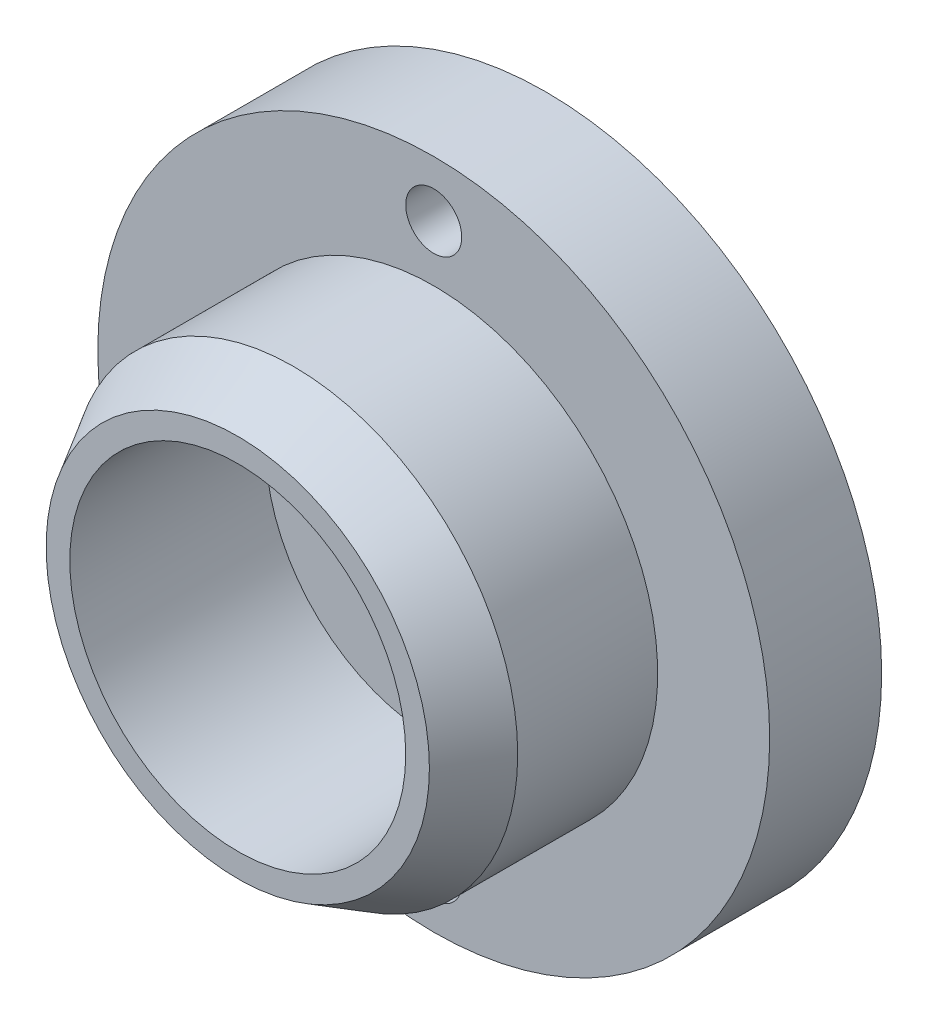
ISO-10303-21;
HEADER;
FILE_DESCRIPTION(('STEP AP214'),'2;1');
FILE_NAME('part.step','',(''),(''),'','','');
FILE_SCHEMA(('AUTOMOTIVE_DESIGN { 1 0 10303 214 1 1 1 1 }'));
ENDSEC;
DATA;
#1=APPLICATION_CONTEXT('core data for automotive mechanical design processes');
#2=APPLICATION_PROTOCOL_DEFINITION('international standard','automotive_design',2000,#1);
#3=PRODUCT_CONTEXT('',#1,'mechanical');
#4=PRODUCT('Part','Part','',(#3));
#5=PRODUCT_RELATED_PRODUCT_CATEGORY('part','',(#4));
#6=PRODUCT_DEFINITION_FORMATION('','',#4);
#7=PRODUCT_DEFINITION_CONTEXT('part definition',#1,'design');
#8=PRODUCT_DEFINITION('design','',#6,#7);
#9=PRODUCT_DEFINITION_SHAPE('','',#8);
#10=(LENGTH_UNIT() NAMED_UNIT(*) SI_UNIT(.MILLI.,.METRE.));
#11=(NAMED_UNIT(*) PLANE_ANGLE_UNIT() SI_UNIT($,.RADIAN.));
#12=(NAMED_UNIT(*) SI_UNIT($,.STERADIAN.) SOLID_ANGLE_UNIT());
#13=UNCERTAINTY_MEASURE_WITH_UNIT(LENGTH_MEASURE(1.E-05),#10,'distance_accuracy_value','');
#14=(GEOMETRIC_REPRESENTATION_CONTEXT(3) GLOBAL_UNCERTAINTY_ASSIGNED_CONTEXT((#13)) GLOBAL_UNIT_ASSIGNED_CONTEXT((#10,
#11,#12)) REPRESENTATION_CONTEXT('',''));
#15=CARTESIAN_POINT('',(0.,0.,0.));
#16=DIRECTION('',(0.,0.,1.));
#17=DIRECTION('',(1.,0.,0.));
#18=AXIS2_PLACEMENT_3D('',#15,#16,#17);
#19=CARTESIAN_POINT('',(0.,0.,3.5));
#20=DIRECTION('',(0.,0.,1.));
#21=DIRECTION('',(1.,0.,0.));
#22=AXIS2_PLACEMENT_3D('',#19,#20,#21);
#23=PLANE('',#22);
#24=CARTESIAN_POINT('',(0.,0.,3.5));
#25=DIRECTION('',(0.,0.,1.));
#26=DIRECTION('',(1.,0.,0.));
#27=AXIS2_PLACEMENT_3D('',#24,#25,#26);
#28=CIRCLE('',#27,3.42264973081038);
#29=CARTESIAN_POINT('',(3.42264973081038,0.,3.5));
#30=VERTEX_POINT('',#29);
#31=EDGE_CURVE('E37',#30,#30,#28,.T.);
#32=ORIENTED_EDGE('',*,*,#31,.T.);
#33=EDGE_LOOP('',(#32));
#34=FACE_BOUND('',#33,.T.);
#35=CARTESIAN_POINT('',(0.,0.,3.5));
#36=DIRECTION('',(0.,0.,1.));
#37=DIRECTION('',(1.,0.,0.));
#38=AXIS2_PLACEMENT_3D('',#35,#36,#37);
#39=CIRCLE('',#38,3.);
#40=CARTESIAN_POINT('',(3.,0.,3.5));
#41=VERTEX_POINT('',#40);
#42=EDGE_CURVE('E41',#41,#41,#39,.T.);
#43=ORIENTED_EDGE('',*,*,#42,.F.);
#44=EDGE_LOOP('',(#43));
#45=FACE_BOUND('',#44,.T.);
#46=ADVANCED_FACE('F30',(#34,#45),#23,.T.);
#47=CARTESIAN_POINT('',(0.,0.,3.5));
#48=DIRECTION('',(0.,0.,-1.));
#49=DIRECTION('',(-1.,0.,0.));
#50=AXIS2_PLACEMENT_3D('',#47,#48,#49);
#51=CYLINDRICAL_SURFACE('',#50,4.);
#52=CARTESIAN_POINT('',(0.,0.,2.5));
#53=DIRECTION('',(0.,0.,1.));
#54=DIRECTION('',(1.,0.,0.));
#55=AXIS2_PLACEMENT_3D('',#52,#53,#54);
#56=CIRCLE('',#55,4.);
#57=CARTESIAN_POINT('',(4.,0.,2.5));
#58=VERTEX_POINT('',#57);
#59=EDGE_CURVE('E10',#58,#58,#56,.F.);
#60=ORIENTED_EDGE('',*,*,#59,.T.);
#61=EDGE_LOOP('',(#60));
#62=FACE_BOUND('',#61,.T.);
#63=CARTESIAN_POINT('',(0.,0.,0.));
#64=DIRECTION('',(0.,0.,-1.));
#65=DIRECTION('',(-1.,0.,0.));
#66=AXIS2_PLACEMENT_3D('',#63,#64,#65);
#67=CIRCLE('',#66,4.);
#68=CARTESIAN_POINT('',(-4.,0.,0.));
#69=VERTEX_POINT('',#68);
#70=EDGE_CURVE('E49',#69,#69,#67,.T.);
#71=ORIENTED_EDGE('',*,*,#70,.F.);
#72=EDGE_LOOP('',(#71));
#73=FACE_BOUND('',#72,.T.);
#74=ADVANCED_FACE('F102',(#62,#73),#51,.T.);
#75=CARTESIAN_POINT('',(0.,0.,3.5));
#76=DIRECTION('',(0.,0.,-1.));
#77=DIRECTION('',(-1.,0.,0.));
#78=AXIS2_PLACEMENT_3D('',#75,#76,#77);
#79=CYLINDRICAL_SURFACE('',#78,3.);
#80=ORIENTED_EDGE('',*,*,#42,.T.);
#81=EDGE_LOOP('',(#80));
#82=FACE_BOUND('',#81,.T.);
#83=CARTESIAN_POINT('',(0.,0.,0.));
#84=DIRECTION('',(0.,0.,1.));
#85=DIRECTION('',(1.,0.,0.));
#86=AXIS2_PLACEMENT_3D('',#83,#84,#85);
#87=CIRCLE('',#86,3.);
#88=CARTESIAN_POINT('',(3.,0.,0.));
#89=VERTEX_POINT('',#88);
#90=EDGE_CURVE('E45',#89,#89,#87,.T.);
#91=ORIENTED_EDGE('',*,*,#90,.F.);
#92=EDGE_LOOP('',(#91));
#93=FACE_BOUND('',#92,.T.);
#94=ADVANCED_FACE('F107',(#82,#93),#79,.F.);
#95=CARTESIAN_POINT('',(0.,0.,3.5));
#96=DIRECTION('',(0.,0.,-1.));
#97=DIRECTION('',(-1.,0.,0.));
#98=AXIS2_PLACEMENT_3D('',#95,#96,#97);
#99=CONICAL_SURFACE('',#98,3.42264973081038,0.523598775598298);
#100=ORIENTED_EDGE('',*,*,#59,.F.);
#101=EDGE_LOOP('',(#100));
#102=FACE_BOUND('',#101,.T.);
#103=ORIENTED_EDGE('',*,*,#31,.F.);
#104=EDGE_LOOP('',(#103));
#105=FACE_BOUND('',#104,.T.);
#106=ADVANCED_FACE('F32',(#102,#105),#99,.T.);
#107=CARTESIAN_POINT('',(0.,0.,0.));
#108=DIRECTION('',(0.,0.,-1.));
#109=DIRECTION('',(-1.,0.,0.));
#110=AXIS2_PLACEMENT_3D('',#107,#108,#109);
#111=PLANE('',#110);
#112=ORIENTED_EDGE('',*,*,#90,.T.);
#113=EDGE_LOOP('',(#112));
#114=FACE_BOUND('',#113,.T.);
#115=ADVANCED_FACE('F81',(#114),#111,.F.);
#116=CARTESIAN_POINT('',(0.,0.,-2.));
#117=DIRECTION('',(0.,0.,1.));
#118=DIRECTION('',(1.,0.,0.));
#119=AXIS2_PLACEMENT_3D('',#116,#117,#118);
#120=CYLINDRICAL_SURFACE('',#119,6.);
#121=CARTESIAN_POINT('',(0.,0.,-2.));
#122=DIRECTION('',(0.,0.,-1.));
#123=DIRECTION('',(-1.,0.,0.));
#124=AXIS2_PLACEMENT_3D('',#121,#122,#123);
#125=CIRCLE('',#124,6.);
#126=CARTESIAN_POINT('',(-6.,0.,-2.));
#127=VERTEX_POINT('',#126);
#128=EDGE_CURVE('E53',#127,#127,#125,.T.);
#129=ORIENTED_EDGE('',*,*,#128,.F.);
#130=EDGE_LOOP('',(#129));
#131=FACE_BOUND('',#130,.T.);
#132=CARTESIAN_POINT('',(0.,0.,0.));
#133=DIRECTION('',(0.,0.,-1.));
#134=DIRECTION('',(-1.,0.,0.));
#135=AXIS2_PLACEMENT_3D('',#132,#133,#134);
#136=CIRCLE('',#135,6.);
#137=CARTESIAN_POINT('',(-6.,0.,0.));
#138=VERTEX_POINT('',#137);
#139=EDGE_CURVE('E54',#138,#138,#136,.T.);
#140=ORIENTED_EDGE('',*,*,#139,.T.);
#141=EDGE_LOOP('',(#140));
#142=FACE_BOUND('',#141,.T.);
#143=ADVANCED_FACE('F88',(#131,#142),#120,.T.);
#144=CARTESIAN_POINT('',(0.,0.,-2.));
#145=DIRECTION('',(0.,0.,-1.));
#146=DIRECTION('',(-1.,0.,0.));
#147=AXIS2_PLACEMENT_3D('',#144,#145,#146);
#148=PLANE('',#147);
#149=CARTESIAN_POINT('',(0.,-5.,-2.));
#150=DIRECTION('',(0.,0.,-1.));
#151=DIRECTION('',(-1.,0.,0.));
#152=AXIS2_PLACEMENT_3D('',#149,#150,#151);
#153=CIRCLE('',#152,0.5);
#154=CARTESIAN_POINT('',(-0.499999999999999,-5.,-2.));
#155=VERTEX_POINT('',#154);
#156=EDGE_CURVE('E65',#155,#155,#153,.F.);
#157=ORIENTED_EDGE('',*,*,#156,.T.);
#158=EDGE_LOOP('',(#157));
#159=FACE_BOUND('',#158,.T.);
#160=CARTESIAN_POINT('',(0.,5.,-2.));
#161=DIRECTION('',(0.,0.,-1.));
#162=DIRECTION('',(-1.,0.,0.));
#163=AXIS2_PLACEMENT_3D('',#160,#161,#162);
#164=CIRCLE('',#163,0.5);
#165=CARTESIAN_POINT('',(-0.5,5.,-2.));
#166=VERTEX_POINT('',#165);
#167=EDGE_CURVE('E57',#166,#166,#164,.F.);
#168=ORIENTED_EDGE('',*,*,#167,.T.);
#169=EDGE_LOOP('',(#168));
#170=FACE_BOUND('',#169,.T.);
#171=ORIENTED_EDGE('',*,*,#128,.T.);
#172=EDGE_LOOP('',(#171));
#173=FACE_BOUND('',#172,.T.);
#174=ADVANCED_FACE('F79',(#159,#170,#173),#148,.T.);
#175=CARTESIAN_POINT('',(0.,-5.,0.));
#176=DIRECTION('',(0.,0.,1.));
#177=DIRECTION('',(1.,0.,0.));
#178=AXIS2_PLACEMENT_3D('',#175,#176,#177);
#179=CIRCLE('',#178,0.5);
#180=CARTESIAN_POINT('',(0.500000000000002,-5.,0.));
#181=VERTEX_POINT('',#180);
#182=EDGE_CURVE('E68',#181,#181,#179,.T.);
#183=ORIENTED_EDGE('',*,*,#182,.F.);
#184=EDGE_LOOP('',(#183));
#185=FACE_BOUND('',#184,.T.);
#186=CARTESIAN_POINT('',(0.,5.,0.));
#187=DIRECTION('',(0.,0.,1.));
#188=DIRECTION('',(1.,0.,0.));
#189=AXIS2_PLACEMENT_3D('',#186,#187,#188);
#190=CIRCLE('',#189,0.5);
#191=CARTESIAN_POINT('',(0.5,5.,0.));
#192=VERTEX_POINT('',#191);
#193=EDGE_CURVE('E62',#192,#192,#190,.T.);
#194=ORIENTED_EDGE('',*,*,#193,.F.);
#195=EDGE_LOOP('',(#194));
#196=FACE_BOUND('',#195,.T.);
#197=ORIENTED_EDGE('',*,*,#70,.T.);
#198=EDGE_LOOP('',(#197));
#199=FACE_BOUND('',#198,.T.);
#200=ORIENTED_EDGE('',*,*,#139,.F.);
#201=EDGE_LOOP('',(#200));
#202=FACE_BOUND('',#201,.T.);
#203=ADVANCED_FACE('F75',(#185,#196,#199,#202),#111,.F.);
#204=CARTESIAN_POINT('',(0.,5.,-3.4142135623731));
#205=DIRECTION('',(0.,0.,1.));
#206=DIRECTION('',(1.,0.,0.));
#207=AXIS2_PLACEMENT_3D('',#204,#205,#206);
#208=CYLINDRICAL_SURFACE('',#207,0.5);
#209=ORIENTED_EDGE('',*,*,#193,.T.);
#210=EDGE_LOOP('',(#209));
#211=FACE_BOUND('',#210,.T.);
#212=ORIENTED_EDGE('',*,*,#167,.F.);
#213=EDGE_LOOP('',(#212));
#214=FACE_BOUND('',#213,.T.);
#215=ADVANCED_FACE('F78',(#211,#214),#208,.F.);
#216=CARTESIAN_POINT('',(0.,-5.,-3.4142135623731));
#217=DIRECTION('',(0.,0.,1.));
#218=DIRECTION('',(1.,0.,0.));
#219=AXIS2_PLACEMENT_3D('',#216,#217,#218);
#220=CYLINDRICAL_SURFACE('',#219,0.5);
#221=ORIENTED_EDGE('',*,*,#182,.T.);
#222=EDGE_LOOP('',(#221));
#223=FACE_BOUND('',#222,.T.);
#224=ORIENTED_EDGE('',*,*,#156,.F.);
#225=EDGE_LOOP('',(#224));
#226=FACE_BOUND('',#225,.T.);
#227=ADVANCED_FACE('F72',(#223,#226),#220,.F.);
#228=CLOSED_SHELL('',(#46,#74,#94,#106,#115,#143,#174,#203,#215,#227));
#229=MANIFOLD_SOLID_BREP('B2',#228);
#230=ADVANCED_BREP_SHAPE_REPRESENTATION('',(#18,#229),#14);
#231=SHAPE_DEFINITION_REPRESENTATION(#9,#230);
ENDSEC;
END-ISO-10303-21;
